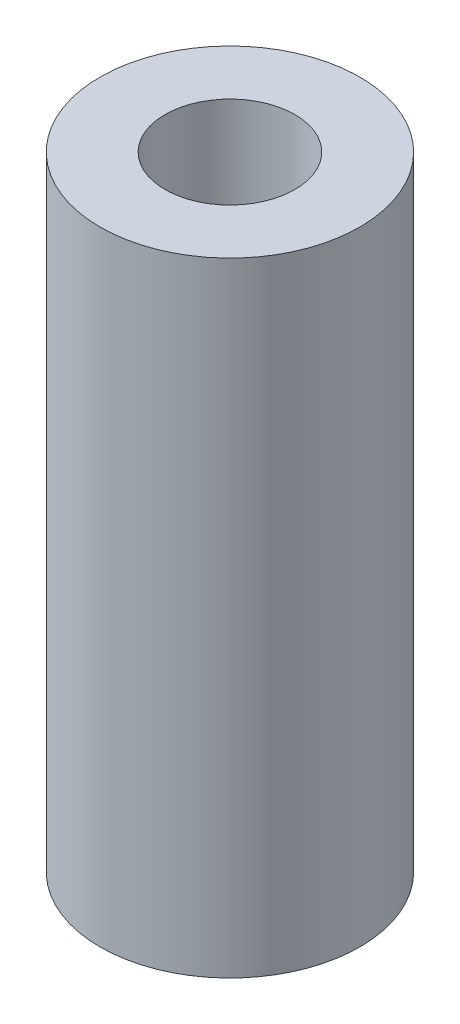
ISO-10303-21;
HEADER;
FILE_DESCRIPTION(('STEP AP214'),'2;1');
FILE_NAME('part.step','',(''),(''),'','','');
FILE_SCHEMA(('AUTOMOTIVE_DESIGN { 1 0 10303 214 1 1 1 1 }'));
ENDSEC;
DATA;
#1=APPLICATION_CONTEXT('core data for automotive mechanical design processes');
#2=APPLICATION_PROTOCOL_DEFINITION('international standard','automotive_design',2000,#1);
#3=PRODUCT_CONTEXT('',#1,'mechanical');
#4=PRODUCT('Part','Part','',(#3));
#5=PRODUCT_RELATED_PRODUCT_CATEGORY('part','',(#4));
#6=PRODUCT_DEFINITION_FORMATION('','',#4);
#7=PRODUCT_DEFINITION_CONTEXT('part definition',#1,'design');
#8=PRODUCT_DEFINITION('design','',#6,#7);
#9=PRODUCT_DEFINITION_SHAPE('','',#8);
#10=(LENGTH_UNIT() NAMED_UNIT(*) SI_UNIT(.MILLI.,.METRE.));
#11=(NAMED_UNIT(*) PLANE_ANGLE_UNIT() SI_UNIT($,.RADIAN.));
#12=(NAMED_UNIT(*) SI_UNIT($,.STERADIAN.) SOLID_ANGLE_UNIT());
#13=UNCERTAINTY_MEASURE_WITH_UNIT(LENGTH_MEASURE(1.E-05),#10,'distance_accuracy_value','');
#14=(GEOMETRIC_REPRESENTATION_CONTEXT(3) GLOBAL_UNCERTAINTY_ASSIGNED_CONTEXT((#13)) GLOBAL_UNIT_ASSIGNED_CONTEXT((#10,
#11,#12)) REPRESENTATION_CONTEXT('',''));
#15=CARTESIAN_POINT('',(0.,0.,0.));
#16=DIRECTION('',(0.,0.,1.));
#17=DIRECTION('',(1.,0.,0.));
#18=AXIS2_PLACEMENT_3D('',#15,#16,#17);
#19=CARTESIAN_POINT('',(0.,12.,0.));
#20=DIRECTION('',(0.,-1.,0.));
#21=DIRECTION('',(0.,0.,-1.));
#22=AXIS2_PLACEMENT_3D('',#19,#20,#21);
#23=CYLINDRICAL_SURFACE('',#22,2.5);
#24=CARTESIAN_POINT('',(0.,12.,0.));
#25=DIRECTION('',(0.,1.,0.));
#26=DIRECTION('',(0.,0.,1.));
#27=AXIS2_PLACEMENT_3D('',#24,#25,#26);
#28=CIRCLE('',#27,2.5);
#29=CARTESIAN_POINT('',(0.,12.,2.5));
#30=VERTEX_POINT('',#29);
#31=EDGE_CURVE('E10',#30,#30,#28,.T.);
#32=ORIENTED_EDGE('',*,*,#31,.F.);
#33=EDGE_LOOP('',(#32));
#34=FACE_BOUND('',#33,.T.);
#35=CARTESIAN_POINT('',(0.,0.,0.));
#36=DIRECTION('',(0.,1.,0.));
#37=DIRECTION('',(0.,0.,1.));
#38=AXIS2_PLACEMENT_3D('',#35,#36,#37);
#39=CIRCLE('',#38,2.5);
#40=CARTESIAN_POINT('',(0.,0.,2.5));
#41=VERTEX_POINT('',#40);
#42=EDGE_CURVE('E39',#41,#41,#39,.T.);
#43=ORIENTED_EDGE('',*,*,#42,.T.);
#44=EDGE_LOOP('',(#43));
#45=FACE_BOUND('',#44,.T.);
#46=ADVANCED_FACE('F36',(#34,#45),#23,.T.);
#47=CARTESIAN_POINT('',(0.,12.,0.));
#48=DIRECTION('',(0.,1.,0.));
#49=DIRECTION('',(0.,0.,1.));
#50=AXIS2_PLACEMENT_3D('',#47,#48,#49);
#51=PLANE('',#50);
#52=CARTESIAN_POINT('',(0.,12.,0.));
#53=DIRECTION('',(0.,-1.,0.));
#54=DIRECTION('',(0.,0.,-1.));
#55=AXIS2_PLACEMENT_3D('',#52,#53,#54);
#56=CIRCLE('',#55,1.25);
#57=CARTESIAN_POINT('',(0.,12.,-1.25));
#58=VERTEX_POINT('',#57);
#59=EDGE_CURVE('E46',#58,#58,#56,.T.);
#60=ORIENTED_EDGE('',*,*,#59,.T.);
#61=EDGE_LOOP('',(#60));
#62=FACE_BOUND('',#61,.T.);
#63=ORIENTED_EDGE('',*,*,#31,.T.);
#64=EDGE_LOOP('',(#63));
#65=FACE_BOUND('',#64,.T.);
#66=ADVANCED_FACE('F59',(#62,#65),#51,.T.);
#67=CARTESIAN_POINT('',(0.,0.,0.));
#68=DIRECTION('',(0.,1.,0.));
#69=DIRECTION('',(0.,0.,1.));
#70=AXIS2_PLACEMENT_3D('',#67,#68,#69);
#71=PLANE('',#70);
#72=CARTESIAN_POINT('',(0.,0.,0.));
#73=DIRECTION('',(0.,-1.,0.));
#74=DIRECTION('',(0.,0.,-1.));
#75=AXIS2_PLACEMENT_3D('',#72,#73,#74);
#76=CIRCLE('',#75,1.24999999999999);
#77=CARTESIAN_POINT('',(0.,0.,-1.24999999999999));
#78=VERTEX_POINT('',#77);
#79=EDGE_CURVE('E50',#78,#78,#76,.T.);
#80=ORIENTED_EDGE('',*,*,#79,.F.);
#81=EDGE_LOOP('',(#80));
#82=FACE_BOUND('',#81,.T.);
#83=ORIENTED_EDGE('',*,*,#42,.F.);
#84=EDGE_LOOP('',(#83));
#85=FACE_BOUND('',#84,.T.);
#86=ADVANCED_FACE('F56',(#82,#85),#71,.F.);
#87=CARTESIAN_POINT('',(0.,0.,0.));
#88=DIRECTION('',(0.,-1.,0.));
#89=DIRECTION('',(0.,0.,-1.));
#90=AXIS2_PLACEMENT_3D('',#87,#88,#89);
#91=CYLINDRICAL_SURFACE('',#90,1.24999999999999);
#92=ORIENTED_EDGE('',*,*,#59,.F.);
#93=EDGE_LOOP('',(#92));
#94=FACE_BOUND('',#93,.T.);
#95=ORIENTED_EDGE('',*,*,#79,.T.);
#96=EDGE_LOOP('',(#95));
#97=FACE_BOUND('',#96,.T.);
#98=ADVANCED_FACE('F54',(#94,#97),#91,.F.);
#99=CLOSED_SHELL('',(#46,#66,#86,#98));
#100=MANIFOLD_SOLID_BREP('B2',#99);
#101=ADVANCED_BREP_SHAPE_REPRESENTATION('',(#18,#100),#14);
#102=SHAPE_DEFINITION_REPRESENTATION(#9,#101);
ENDSEC;
END-ISO-10303-21;
